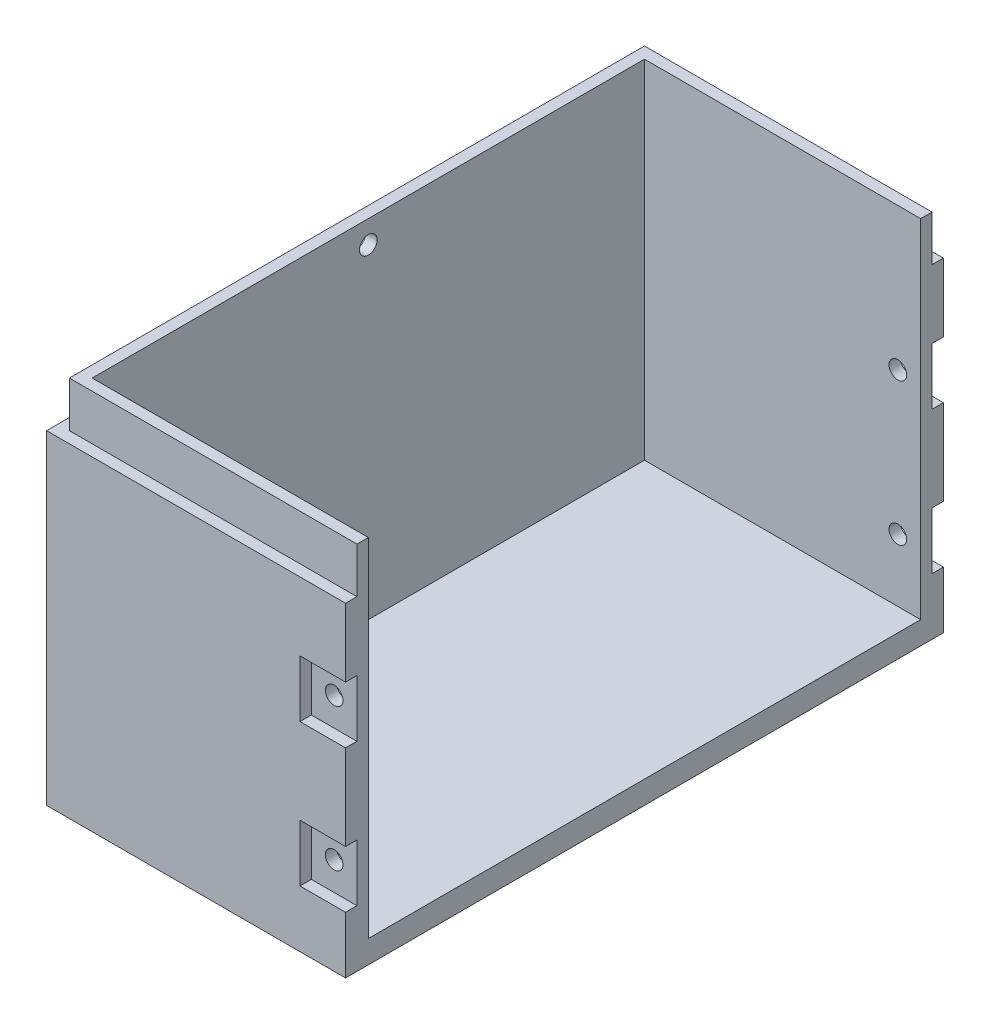
ISO-10303-21;
HEADER;
FILE_DESCRIPTION(('STEP AP214'),'2;1');
FILE_NAME('part.step','',(''),(''),'','','');
FILE_SCHEMA(('AUTOMOTIVE_DESIGN { 1 0 10303 214 1 1 1 1 }'));
ENDSEC;
DATA;
#1=APPLICATION_CONTEXT('core data for automotive mechanical design processes');
#2=APPLICATION_PROTOCOL_DEFINITION('international standard','automotive_design',2000,#1);
#3=PRODUCT_CONTEXT('',#1,'mechanical');
#4=PRODUCT('Part','Part','',(#3));
#5=PRODUCT_RELATED_PRODUCT_CATEGORY('part','',(#4));
#6=PRODUCT_DEFINITION_FORMATION('','',#4);
#7=PRODUCT_DEFINITION_CONTEXT('part definition',#1,'design');
#8=PRODUCT_DEFINITION('design','',#6,#7);
#9=PRODUCT_DEFINITION_SHAPE('','',#8);
#10=(LENGTH_UNIT() NAMED_UNIT(*) SI_UNIT(.MILLI.,.METRE.));
#11=(NAMED_UNIT(*) PLANE_ANGLE_UNIT() SI_UNIT($,.RADIAN.));
#12=(NAMED_UNIT(*) SI_UNIT($,.STERADIAN.) SOLID_ANGLE_UNIT());
#13=UNCERTAINTY_MEASURE_WITH_UNIT(LENGTH_MEASURE(1.E-05),#10,'distance_accuracy_value','');
#14=(GEOMETRIC_REPRESENTATION_CONTEXT(3) GLOBAL_UNCERTAINTY_ASSIGNED_CONTEXT((#13)) GLOBAL_UNIT_ASSIGNED_CONTEXT((#10,
#11,#12)) REPRESENTATION_CONTEXT('',''));
#15=CARTESIAN_POINT('',(0.,0.,0.));
#16=DIRECTION('',(0.,0.,1.));
#17=DIRECTION('',(1.,0.,0.));
#18=AXIS2_PLACEMENT_3D('',#15,#16,#17);
#19=CARTESIAN_POINT('',(0.,0.,-50.5));
#20=DIRECTION('',(0.,0.,-1.));
#21=DIRECTION('',(-1.,0.,0.));
#22=AXIS2_PLACEMENT_3D('',#19,#20,#21);
#23=PLANE('',#22);
#24=CARTESIAN_POINT('',(22.25,15.,-50.5));
#25=DIRECTION('',(0.,0.,-1.));
#26=DIRECTION('',(-1.,0.,0.));
#27=AXIS2_PLACEMENT_3D('',#24,#25,#26);
#28=CIRCLE('',#27,1.55);
#29=CARTESIAN_POINT('',(20.7,15.,-50.5));
#30=VERTEX_POINT('',#29);
#31=EDGE_CURVE('E368',#30,#30,#28,.T.);
#32=ORIENTED_EDGE('',*,*,#31,.F.);
#33=EDGE_LOOP('',(#32));
#34=FACE_BOUND('',#33,.T.);
#35=DIRECTION('',(0.,-1.,0.));
#36=VECTOR('',#35,1.);
#37=CARTESIAN_POINT('',(18.25,0.,-50.5));
#38=LINE('',#37,#36);
#39=CARTESIAN_POINT('',(18.25,20.,-50.5));
#40=VERTEX_POINT('',#39);
#41=CARTESIAN_POINT('',(18.25,10.,-50.5));
#42=VERTEX_POINT('',#41);
#43=EDGE_CURVE('E242',#40,#42,#38,.T.);
#44=ORIENTED_EDGE('',*,*,#43,.F.);
#45=DIRECTION('',(-1.,0.,0.));
#46=VECTOR('',#45,1.);
#47=CARTESIAN_POINT('',(26.25,20.,-50.5));
#48=LINE('',#47,#46);
#49=CARTESIAN_POINT('',(26.25,20.,-50.5));
#50=VERTEX_POINT('',#49);
#51=EDGE_CURVE('E228',#50,#40,#48,.T.);
#52=ORIENTED_EDGE('',*,*,#51,.F.);
#53=DIRECTION('',(0.,-1.,0.));
#54=VECTOR('',#53,1.);
#55=CARTESIAN_POINT('',(26.25,0.,-50.5));
#56=LINE('',#55,#54);
#57=CARTESIAN_POINT('',(26.25,10.,-50.5));
#58=VERTEX_POINT('',#57);
#59=EDGE_CURVE('E240',#50,#58,#56,.T.);
#60=ORIENTED_EDGE('',*,*,#59,.T.);
#61=DIRECTION('',(1.,0.,0.));
#62=VECTOR('',#61,1.);
#63=CARTESIAN_POINT('',(18.25,10.,-50.5));
#64=LINE('',#63,#62);
#65=EDGE_CURVE('E452',#42,#58,#64,.T.);
#66=ORIENTED_EDGE('',*,*,#65,.F.);
#67=EDGE_LOOP('',(#44,#52,#60,#66));
#68=FACE_BOUND('',#67,.T.);
#69=ADVANCED_FACE('F39',(#34,#68),#23,.T.);
#70=CARTESIAN_POINT('',(18.25,0.,-50.5));
#71=DIRECTION('',(1.,0.,0.));
#72=DIRECTION('',(0.,1.,0.));
#73=AXIS2_PLACEMENT_3D('',#70,#71,#72);
#74=PLANE('',#73);
#75=DIRECTION('',(0.,-1.,0.));
#76=VECTOR('',#75,1.);
#77=CARTESIAN_POINT('',(18.25,0.,-52.5));
#78=LINE('',#77,#76);
#79=CARTESIAN_POINT('',(18.25,20.,-52.5));
#80=VERTEX_POINT('',#79);
#81=CARTESIAN_POINT('',(18.25,10.,-52.5));
#82=VERTEX_POINT('',#81);
#83=EDGE_CURVE('E413',#80,#82,#78,.T.);
#84=ORIENTED_EDGE('',*,*,#83,.F.);
#85=DIRECTION('',(0.,0.,1.));
#86=VECTOR('',#85,1.);
#87=CARTESIAN_POINT('',(18.25,20.,-52.5));
#88=LINE('',#87,#86);
#89=EDGE_CURVE('E57',#80,#40,#88,.T.);
#90=ORIENTED_EDGE('',*,*,#89,.T.);
#91=ORIENTED_EDGE('',*,*,#43,.T.);
#92=DIRECTION('',(0.,0.,1.));
#93=VECTOR('',#92,1.);
#94=CARTESIAN_POINT('',(18.25,10.,-52.5));
#95=LINE('',#94,#93);
#96=EDGE_CURVE('E468',#82,#42,#95,.T.);
#97=ORIENTED_EDGE('',*,*,#96,.F.);
#98=EDGE_LOOP('',(#84,#90,#91,#97));
#99=FACE_BOUND('',#98,.T.);
#100=ADVANCED_FACE('F603',(#99),#74,.T.);
#101=CARTESIAN_POINT('',(26.25,65.,-50.5));
#102=VERTEX_POINT('',#101);
#103=CARTESIAN_POINT('',(26.25,57.,-50.5));
#104=VERTEX_POINT('',#103);
#105=EDGE_CURVE('E256',#102,#104,#56,.T.);
#106=ORIENTED_EDGE('',*,*,#105,.T.);
#107=DIRECTION('',(-1.,0.,0.));
#108=VECTOR('',#107,1.);
#109=CARTESIAN_POINT('',(0.,57.,-50.5));
#110=LINE('',#109,#108);
#111=CARTESIAN_POINT('',(-24.25,57.,-50.5));
#112=VERTEX_POINT('',#111);
#113=EDGE_CURVE('E260',#104,#112,#110,.T.);
#114=ORIENTED_EDGE('',*,*,#113,.T.);
#115=DIRECTION('',(0.,-1.,0.));
#116=VECTOR('',#115,1.);
#117=CARTESIAN_POINT('',(-24.25,65.,-50.5));
#118=LINE('',#117,#116);
#119=CARTESIAN_POINT('',(-24.25,65.,-50.5));
#120=VERTEX_POINT('',#119);
#121=EDGE_CURVE('E377',#120,#112,#118,.T.);
#122=ORIENTED_EDGE('',*,*,#121,.F.);
#123=DIRECTION('',(1.,0.,0.));
#124=VECTOR('',#123,1.);
#125=CARTESIAN_POINT('',(0.,65.,-50.5));
#126=LINE('',#125,#124);
#127=EDGE_CURVE('E254',#120,#102,#126,.T.);
#128=ORIENTED_EDGE('',*,*,#127,.T.);
#129=EDGE_LOOP('',(#106,#114,#122,#128));
#130=FACE_BOUND('',#129,.T.);
#131=ADVANCED_FACE('F426',(#130),#23,.T.);
#132=DIRECTION('',(-1.,0.,0.));
#133=VECTOR('',#132,1.);
#134=CARTESIAN_POINT('',(26.25,35.,-50.5));
#135=LINE('',#134,#133);
#136=CARTESIAN_POINT('',(26.25,35.,-50.5));
#137=VERTEX_POINT('',#136);
#138=CARTESIAN_POINT('',(18.25,35.,-50.5));
#139=VERTEX_POINT('',#138);
#140=EDGE_CURVE('E245',#137,#139,#135,.T.);
#141=ORIENTED_EDGE('',*,*,#140,.T.);
#142=CARTESIAN_POINT('',(18.25,45.,-50.5));
#143=VERTEX_POINT('',#142);
#144=EDGE_CURVE('E420',#143,#139,#38,.T.);
#145=ORIENTED_EDGE('',*,*,#144,.F.);
#146=DIRECTION('',(1.,0.,0.));
#147=VECTOR('',#146,1.);
#148=CARTESIAN_POINT('',(18.25,45.,-50.5));
#149=LINE('',#148,#147);
#150=CARTESIAN_POINT('',(26.25,45.,-50.5));
#151=VERTEX_POINT('',#150);
#152=EDGE_CURVE('E448',#143,#151,#149,.T.);
#153=ORIENTED_EDGE('',*,*,#152,.T.);
#154=EDGE_CURVE('E253',#151,#137,#56,.T.);
#155=ORIENTED_EDGE('',*,*,#154,.T.);
#156=EDGE_LOOP('',(#141,#145,#153,#155));
#157=FACE_BOUND('',#156,.T.);
#158=CARTESIAN_POINT('',(22.25,40.,-50.5));
#159=DIRECTION('',(0.,0.,-1.));
#160=DIRECTION('',(-1.,0.,0.));
#161=AXIS2_PLACEMENT_3D('',#158,#159,#160);
#162=CIRCLE('',#161,1.55);
#163=CARTESIAN_POINT('',(20.7,40.,-50.5));
#164=VERTEX_POINT('',#163);
#165=EDGE_CURVE('E347',#164,#164,#162,.T.);
#166=ORIENTED_EDGE('',*,*,#165,.F.);
#167=EDGE_LOOP('',(#166));
#168=FACE_BOUND('',#167,.T.);
#169=ADVANCED_FACE('F606',(#157,#168),#23,.T.);
#170=DIRECTION('',(0.,0.,1.));
#171=VECTOR('',#170,1.);
#172=CARTESIAN_POINT('',(18.25,35.,-52.5));
#173=LINE('',#172,#171);
#174=CARTESIAN_POINT('',(18.25,35.,-52.5));
#175=VERTEX_POINT('',#174);
#176=EDGE_CURVE('E693',#175,#139,#173,.T.);
#177=ORIENTED_EDGE('',*,*,#176,.F.);
#178=CARTESIAN_POINT('',(18.25,45.,-52.5));
#179=VERTEX_POINT('',#178);
#180=EDGE_CURVE('E680',#179,#175,#78,.T.);
#181=ORIENTED_EDGE('',*,*,#180,.F.);
#182=DIRECTION('',(0.,0.,1.));
#183=VECTOR('',#182,1.);
#184=CARTESIAN_POINT('',(18.25,45.,-52.5));
#185=LINE('',#184,#183);
#186=EDGE_CURVE('E244',#179,#143,#185,.T.);
#187=ORIENTED_EDGE('',*,*,#186,.T.);
#188=ORIENTED_EDGE('',*,*,#144,.T.);
#189=EDGE_LOOP('',(#177,#181,#187,#188));
#190=FACE_BOUND('',#189,.T.);
#191=ADVANCED_FACE('F612',(#190),#74,.T.);
#192=CARTESIAN_POINT('',(0.,0.,50.5));
#193=DIRECTION('',(0.,0.,1.));
#194=DIRECTION('',(1.,0.,0.));
#195=AXIS2_PLACEMENT_3D('',#192,#193,#194);
#196=PLANE('',#195);
#197=CARTESIAN_POINT('',(22.25,15.,50.5));
#198=DIRECTION('',(0.,0.,1.));
#199=DIRECTION('',(1.,0.,0.));
#200=AXIS2_PLACEMENT_3D('',#197,#198,#199);
#201=CIRCLE('',#200,1.55);
#202=CARTESIAN_POINT('',(23.8,15.,50.5));
#203=VERTEX_POINT('',#202);
#204=EDGE_CURVE('E341',#203,#203,#201,.T.);
#205=ORIENTED_EDGE('',*,*,#204,.F.);
#206=EDGE_LOOP('',(#205));
#207=FACE_BOUND('',#206,.T.);
#208=DIRECTION('',(0.,1.,0.));
#209=VECTOR('',#208,1.);
#210=CARTESIAN_POINT('',(26.25,0.,50.5));
#211=LINE('',#210,#209);
#212=CARTESIAN_POINT('',(26.25,9.99999999999999,50.5));
#213=VERTEX_POINT('',#212);
#214=CARTESIAN_POINT('',(26.25,20.,50.5));
#215=VERTEX_POINT('',#214);
#216=EDGE_CURVE('E405',#213,#215,#211,.T.);
#217=ORIENTED_EDGE('',*,*,#216,.T.);
#218=DIRECTION('',(1.,0.,0.));
#219=VECTOR('',#218,1.);
#220=CARTESIAN_POINT('',(18.25,20.,50.5));
#221=LINE('',#220,#219);
#222=CARTESIAN_POINT('',(18.25,20.,50.5));
#223=VERTEX_POINT('',#222);
#224=EDGE_CURVE('E65',#223,#215,#221,.T.);
#225=ORIENTED_EDGE('',*,*,#224,.F.);
#226=DIRECTION('',(0.,-1.,0.));
#227=VECTOR('',#226,1.);
#228=CARTESIAN_POINT('',(18.25,0.,50.5));
#229=LINE('',#228,#227);
#230=CARTESIAN_POINT('',(18.25,10.,50.5));
#231=VERTEX_POINT('',#230);
#232=EDGE_CURVE('E398',#223,#231,#229,.T.);
#233=ORIENTED_EDGE('',*,*,#232,.T.);
#234=DIRECTION('',(-1.,0.,0.));
#235=VECTOR('',#234,1.);
#236=CARTESIAN_POINT('',(26.25,10.,50.5));
#237=LINE('',#236,#235);
#238=EDGE_CURVE('E505',#213,#231,#237,.T.);
#239=ORIENTED_EDGE('',*,*,#238,.F.);
#240=EDGE_LOOP('',(#217,#225,#233,#239));
#241=FACE_BOUND('',#240,.T.);
#242=ADVANCED_FACE('F622',(#207,#241),#196,.T.);
#243=CARTESIAN_POINT('',(22.25,40.,50.5));
#244=DIRECTION('',(0.,0.,1.));
#245=DIRECTION('',(1.,0.,0.));
#246=AXIS2_PLACEMENT_3D('',#243,#244,#245);
#247=CIRCLE('',#246,1.55);
#248=CARTESIAN_POINT('',(23.8,40.,50.5));
#249=VERTEX_POINT('',#248);
#250=EDGE_CURVE('E350',#249,#249,#247,.T.);
#251=ORIENTED_EDGE('',*,*,#250,.F.);
#252=EDGE_LOOP('',(#251));
#253=FACE_BOUND('',#252,.T.);
#254=CARTESIAN_POINT('',(18.25,45.,50.5));
#255=VERTEX_POINT('',#254);
#256=CARTESIAN_POINT('',(18.25,35.,50.5));
#257=VERTEX_POINT('',#256);
#258=EDGE_CURVE('E400',#255,#257,#229,.T.);
#259=ORIENTED_EDGE('',*,*,#258,.T.);
#260=DIRECTION('',(-1.,0.,0.));
#261=VECTOR('',#260,1.);
#262=CARTESIAN_POINT('',(18.25,35.,50.5));
#263=LINE('',#262,#261);
#264=CARTESIAN_POINT('',(26.25,35.,50.5));
#265=VERTEX_POINT('',#264);
#266=EDGE_CURVE('E478',#265,#257,#263,.T.);
#267=ORIENTED_EDGE('',*,*,#266,.F.);
#268=CARTESIAN_POINT('',(26.25,45.,50.5));
#269=VERTEX_POINT('',#268);
#270=EDGE_CURVE('E409',#265,#269,#211,.T.);
#271=ORIENTED_EDGE('',*,*,#270,.T.);
#272=DIRECTION('',(1.,0.,0.));
#273=VECTOR('',#272,1.);
#274=CARTESIAN_POINT('',(18.25,45.,50.5));
#275=LINE('',#274,#273);
#276=EDGE_CURVE('E525',#255,#269,#275,.T.);
#277=ORIENTED_EDGE('',*,*,#276,.F.);
#278=EDGE_LOOP('',(#259,#267,#271,#277));
#279=FACE_BOUND('',#278,.T.);
#280=ADVANCED_FACE('F556',(#253,#279),#196,.T.);
#281=CARTESIAN_POINT('',(18.25,0.,50.5));
#282=DIRECTION('',(-1.,0.,0.));
#283=DIRECTION('',(0.,-1.,0.));
#284=AXIS2_PLACEMENT_3D('',#281,#282,#283);
#285=PLANE('',#284);
#286=DIRECTION('',(0.,0.,-1.));
#287=VECTOR('',#286,1.);
#288=CARTESIAN_POINT('',(18.25,20.,52.5));
#289=LINE('',#288,#287);
#290=CARTESIAN_POINT('',(18.25,20.,52.5));
#291=VERTEX_POINT('',#290);
#292=EDGE_CURVE('E501',#291,#223,#289,.T.);
#293=ORIENTED_EDGE('',*,*,#292,.F.);
#294=DIRECTION('',(0.,-1.,0.));
#295=VECTOR('',#294,1.);
#296=CARTESIAN_POINT('',(18.25,0.,52.5));
#297=LINE('',#296,#295);
#298=CARTESIAN_POINT('',(18.25,9.99999999999999,52.5));
#299=VERTEX_POINT('',#298);
#300=EDGE_CURVE('E417',#291,#299,#297,.T.);
#301=ORIENTED_EDGE('',*,*,#300,.T.);
#302=DIRECTION('',(0.,0.,-1.));
#303=VECTOR('',#302,1.);
#304=CARTESIAN_POINT('',(18.25,10.,52.5));
#305=LINE('',#304,#303);
#306=EDGE_CURVE('E514',#299,#231,#305,.T.);
#307=ORIENTED_EDGE('',*,*,#306,.T.);
#308=ORIENTED_EDGE('',*,*,#232,.F.);
#309=EDGE_LOOP('',(#293,#301,#307,#308));
#310=FACE_BOUND('',#309,.T.);
#311=ADVANCED_FACE('F937',(#310),#285,.F.);
#312=DIRECTION('',(0.,0.,-1.));
#313=VECTOR('',#312,1.);
#314=CARTESIAN_POINT('',(18.25,35.,52.5));
#315=LINE('',#314,#313);
#316=CARTESIAN_POINT('',(18.25,35.,52.5));
#317=VERTEX_POINT('',#316);
#318=EDGE_CURVE('E485',#317,#257,#315,.T.);
#319=ORIENTED_EDGE('',*,*,#318,.T.);
#320=ORIENTED_EDGE('',*,*,#258,.F.);
#321=DIRECTION('',(0.,0.,-1.));
#322=VECTOR('',#321,1.);
#323=CARTESIAN_POINT('',(18.25,45.,52.5));
#324=LINE('',#323,#322);
#325=CARTESIAN_POINT('',(18.25,45.,52.5));
#326=VERTEX_POINT('',#325);
#327=EDGE_CURVE('E356',#326,#255,#324,.T.);
#328=ORIENTED_EDGE('',*,*,#327,.F.);
#329=EDGE_CURVE('E399',#326,#317,#297,.T.);
#330=ORIENTED_EDGE('',*,*,#329,.T.);
#331=EDGE_LOOP('',(#319,#320,#328,#330));
#332=FACE_BOUND('',#331,.T.);
#333=ADVANCED_FACE('F553',(#332),#285,.F.);
#334=DIRECTION('',(-1.,0.,0.));
#335=VECTOR('',#334,1.);
#336=CARTESIAN_POINT('',(0.,57.,50.5));
#337=LINE('',#336,#335);
#338=CARTESIAN_POINT('',(26.25,57.,50.5));
#339=VERTEX_POINT('',#338);
#340=CARTESIAN_POINT('',(-24.25,57.,50.5));
#341=VERTEX_POINT('',#340);
#342=EDGE_CURVE('E394',#339,#341,#337,.T.);
#343=ORIENTED_EDGE('',*,*,#342,.F.);
#344=CARTESIAN_POINT('',(26.25,65.,50.5));
#345=VERTEX_POINT('',#344);
#346=EDGE_CURVE('E404',#339,#345,#211,.T.);
#347=ORIENTED_EDGE('',*,*,#346,.T.);
#348=DIRECTION('',(-1.,0.,0.));
#349=VECTOR('',#348,1.);
#350=CARTESIAN_POINT('',(0.,65.,50.5));
#351=LINE('',#350,#349);
#352=CARTESIAN_POINT('',(-24.25,65.,50.5));
#353=VERTEX_POINT('',#352);
#354=EDGE_CURVE('E408',#345,#353,#351,.T.);
#355=ORIENTED_EDGE('',*,*,#354,.T.);
#356=DIRECTION('',(0.,1.,0.));
#357=VECTOR('',#356,1.);
#358=CARTESIAN_POINT('',(-24.25,65.,50.5));
#359=LINE('',#358,#357);
#360=EDGE_CURVE('E387',#341,#353,#359,.T.);
#361=ORIENTED_EDGE('',*,*,#360,.F.);
#362=EDGE_LOOP('',(#343,#347,#355,#361));
#363=FACE_BOUND('',#362,.T.);
#364=ADVANCED_FACE('F567',(#363),#196,.T.);
#365=CARTESIAN_POINT('',(0.,65.,0.));
#366=DIRECTION('',(0.,1.,0.));
#367=DIRECTION('',(0.,0.,1.));
#368=AXIS2_PLACEMENT_3D('',#365,#366,#367);
#369=PLANE('',#368);
#370=ORIENTED_EDGE('',*,*,#127,.F.);
#371=DIRECTION('',(0.,0.,-1.));
#372=VECTOR('',#371,1.);
#373=CARTESIAN_POINT('',(-24.25,65.,-50.5));
#374=LINE('',#373,#372);
#375=EDGE_CURVE('E390',#353,#120,#374,.T.);
#376=ORIENTED_EDGE('',*,*,#375,.F.);
#377=ORIENTED_EDGE('',*,*,#354,.F.);
#378=DIRECTION('',(0.,0.,-1.));
#379=VECTOR('',#378,1.);
#380=CARTESIAN_POINT('',(26.25,65.,-52.5));
#381=LINE('',#380,#379);
#382=CARTESIAN_POINT('',(26.25,65.,48.5));
#383=VERTEX_POINT('',#382);
#384=EDGE_CURVE('E319',#345,#383,#381,.T.);
#385=ORIENTED_EDGE('',*,*,#384,.T.);
#386=DIRECTION('',(1.,0.,0.));
#387=VECTOR('',#386,1.);
#388=CARTESIAN_POINT('',(-22.25,65.,48.5));
#389=LINE('',#388,#387);
#390=CARTESIAN_POINT('',(-22.25,65.,48.5));
#391=VERTEX_POINT('',#390);
#392=EDGE_CURVE('E305',#391,#383,#389,.T.);
#393=ORIENTED_EDGE('',*,*,#392,.F.);
#394=DIRECTION('',(0.,0.,1.));
#395=VECTOR('',#394,1.);
#396=CARTESIAN_POINT('',(-22.25,65.,48.5));
#397=LINE('',#396,#395);
#398=CARTESIAN_POINT('',(-22.25,65.,-48.5));
#399=VERTEX_POINT('',#398);
#400=EDGE_CURVE('E295',#399,#391,#397,.T.);
#401=ORIENTED_EDGE('',*,*,#400,.F.);
#402=DIRECTION('',(1.,0.,0.));
#403=VECTOR('',#402,1.);
#404=CARTESIAN_POINT('',(-22.25,65.,-48.5));
#405=LINE('',#404,#403);
#406=CARTESIAN_POINT('',(26.25,65.,-48.5));
#407=VERTEX_POINT('',#406);
#408=EDGE_CURVE('E310',#399,#407,#405,.T.);
#409=ORIENTED_EDGE('',*,*,#408,.T.);
#410=EDGE_CURVE('E322',#407,#102,#381,.T.);
#411=ORIENTED_EDGE('',*,*,#410,.T.);
#412=EDGE_LOOP('',(#370,#376,#377,#385,#393,#401,#409,#411));
#413=FACE_BOUND('',#412,.T.);
#414=ADVANCED_FACE('F573',(#413),#369,.T.);
#415=CARTESIAN_POINT('',(26.25,65.,-52.5));
#416=DIRECTION('',(-1.,0.,0.));
#417=DIRECTION('',(0.,0.,1.));
#418=AXIS2_PLACEMENT_3D('',#415,#416,#417);
#419=PLANE('',#418);
#420=ORIENTED_EDGE('',*,*,#216,.F.);
#421=DIRECTION('',(0.,0.,-1.));
#422=VECTOR('',#421,1.);
#423=CARTESIAN_POINT('',(26.25,10.,52.5));
#424=LINE('',#423,#422);
#425=CARTESIAN_POINT('',(26.25,10.,52.5));
#426=VERTEX_POINT('',#425);
#427=EDGE_CURVE('E521',#426,#213,#424,.T.);
#428=ORIENTED_EDGE('',*,*,#427,.F.);
#429=DIRECTION('',(0.,1.,0.));
#430=VECTOR('',#429,1.);
#431=CARTESIAN_POINT('',(26.25,0.,52.5));
#432=LINE('',#431,#430);
#433=CARTESIAN_POINT('',(26.25,0.,52.5));
#434=VERTEX_POINT('',#433);
#435=EDGE_CURVE('E506',#434,#426,#432,.T.);
#436=ORIENTED_EDGE('',*,*,#435,.F.);
#437=DIRECTION('',(0.,0.,-1.));
#438=VECTOR('',#437,1.);
#439=CARTESIAN_POINT('',(26.25,0.,-52.5));
#440=LINE('',#439,#438);
#441=CARTESIAN_POINT('',(26.25,0.,-52.5));
#442=VERTEX_POINT('',#441);
#443=EDGE_CURVE('E309',#434,#442,#440,.T.);
#444=ORIENTED_EDGE('',*,*,#443,.T.);
#445=DIRECTION('',(0.,-1.,0.));
#446=VECTOR('',#445,1.);
#447=CARTESIAN_POINT('',(26.25,10.,-52.5));
#448=LINE('',#447,#446);
#449=CARTESIAN_POINT('',(26.25,10.,-52.5));
#450=VERTEX_POINT('',#449);
#451=EDGE_CURVE('E459',#450,#442,#448,.T.);
#452=ORIENTED_EDGE('',*,*,#451,.F.);
#453=DIRECTION('',(0.,0.,1.));
#454=VECTOR('',#453,1.);
#455=CARTESIAN_POINT('',(26.25,10.,-52.5));
#456=LINE('',#455,#454);
#457=EDGE_CURVE('E251',#450,#58,#456,.T.);
#458=ORIENTED_EDGE('',*,*,#457,.T.);
#459=ORIENTED_EDGE('',*,*,#59,.F.);
#460=DIRECTION('',(0.,0.,1.));
#461=VECTOR('',#460,1.);
#462=CARTESIAN_POINT('',(26.25,20.,-52.5));
#463=LINE('',#462,#461);
#464=CARTESIAN_POINT('',(26.25,20.,-52.5));
#465=VERTEX_POINT('',#464);
#466=EDGE_CURVE('E225',#465,#50,#463,.T.);
#467=ORIENTED_EDGE('',*,*,#466,.F.);
#468=DIRECTION('',(0.,-1.,0.));
#469=VECTOR('',#468,1.);
#470=CARTESIAN_POINT('',(26.25,35.,-52.5));
#471=LINE('',#470,#469);
#472=CARTESIAN_POINT('',(26.25,35.,-52.5));
#473=VERTEX_POINT('',#472);
#474=EDGE_CURVE('E234',#473,#465,#471,.T.);
#475=ORIENTED_EDGE('',*,*,#474,.F.);
#476=DIRECTION('',(0.,0.,1.));
#477=VECTOR('',#476,1.);
#478=CARTESIAN_POINT('',(26.25,35.,-52.5));
#479=LINE('',#478,#477);
#480=EDGE_CURVE('E235',#473,#137,#479,.T.);
#481=ORIENTED_EDGE('',*,*,#480,.T.);
#482=ORIENTED_EDGE('',*,*,#154,.F.);
#483=DIRECTION('',(0.,0.,1.));
#484=VECTOR('',#483,1.);
#485=CARTESIAN_POINT('',(26.25,45.,-52.5));
#486=LINE('',#485,#484);
#487=CARTESIAN_POINT('',(26.25,45.,-52.5));
#488=VERTEX_POINT('',#487);
#489=EDGE_CURVE('E439',#488,#151,#486,.T.);
#490=ORIENTED_EDGE('',*,*,#489,.F.);
#491=DIRECTION('',(0.,-1.,0.));
#492=VECTOR('',#491,1.);
#493=CARTESIAN_POINT('',(26.25,57.,-52.5));
#494=LINE('',#493,#492);
#495=CARTESIAN_POINT('',(26.25,57.,-52.5));
#496=VERTEX_POINT('',#495);
#497=EDGE_CURVE('E437',#496,#488,#494,.T.);
#498=ORIENTED_EDGE('',*,*,#497,.F.);
#499=DIRECTION('',(0.,0.,1.));
#500=VECTOR('',#499,1.);
#501=CARTESIAN_POINT('',(26.25,57.,-52.5));
#502=LINE('',#501,#500);
#503=EDGE_CURVE('E432',#496,#104,#502,.T.);
#504=ORIENTED_EDGE('',*,*,#503,.T.);
#505=ORIENTED_EDGE('',*,*,#105,.F.);
#506=ORIENTED_EDGE('',*,*,#410,.F.);
#507=DIRECTION('',(0.,1.,0.));
#508=VECTOR('',#507,1.);
#509=CARTESIAN_POINT('',(26.25,65.,-48.5));
#510=LINE('',#509,#508);
#511=CARTESIAN_POINT('',(26.25,4.,-48.5));
#512=VERTEX_POINT('',#511);
#513=EDGE_CURVE('E288',#512,#407,#510,.T.);
#514=ORIENTED_EDGE('',*,*,#513,.F.);
#515=DIRECTION('',(0.,0.,-1.));
#516=VECTOR('',#515,1.);
#517=CARTESIAN_POINT('',(26.25,4.,48.5));
#518=LINE('',#517,#516);
#519=CARTESIAN_POINT('',(26.25,4.,48.5));
#520=VERTEX_POINT('',#519);
#521=EDGE_CURVE('E278',#520,#512,#518,.T.);
#522=ORIENTED_EDGE('',*,*,#521,.F.);
#523=DIRECTION('',(0.,-1.,0.));
#524=VECTOR('',#523,1.);
#525=CARTESIAN_POINT('',(26.25,65.,48.5));
#526=LINE('',#525,#524);
#527=EDGE_CURVE('E271',#383,#520,#526,.T.);
#528=ORIENTED_EDGE('',*,*,#527,.F.);
#529=ORIENTED_EDGE('',*,*,#384,.F.);
#530=ORIENTED_EDGE('',*,*,#346,.F.);
#531=DIRECTION('',(0.,0.,-1.));
#532=VECTOR('',#531,1.);
#533=CARTESIAN_POINT('',(26.25,57.,52.5));
#534=LINE('',#533,#532);
#535=CARTESIAN_POINT('',(26.25,57.,52.5));
#536=VERTEX_POINT('',#535);
#537=EDGE_CURVE('E533',#536,#339,#534,.T.);
#538=ORIENTED_EDGE('',*,*,#537,.F.);
#539=DIRECTION('',(0.,1.,0.));
#540=VECTOR('',#539,1.);
#541=CARTESIAN_POINT('',(26.25,57.,52.5));
#542=LINE('',#541,#540);
#543=CARTESIAN_POINT('',(26.25,45.,52.5));
#544=VERTEX_POINT('',#543);
#545=EDGE_CURVE('E529',#544,#536,#542,.T.);
#546=ORIENTED_EDGE('',*,*,#545,.F.);
#547=DIRECTION('',(0.,0.,-1.));
#548=VECTOR('',#547,1.);
#549=CARTESIAN_POINT('',(26.25,45.,52.5));
#550=LINE('',#549,#548);
#551=EDGE_CURVE('E539',#544,#269,#550,.T.);
#552=ORIENTED_EDGE('',*,*,#551,.T.);
#553=ORIENTED_EDGE('',*,*,#270,.F.);
#554=DIRECTION('',(0.,0.,-1.));
#555=VECTOR('',#554,1.);
#556=CARTESIAN_POINT('',(26.25,35.,52.5));
#557=LINE('',#556,#555);
#558=CARTESIAN_POINT('',(26.25,35.,52.5));
#559=VERTEX_POINT('',#558);
#560=EDGE_CURVE('E493',#559,#265,#557,.T.);
#561=ORIENTED_EDGE('',*,*,#560,.F.);
#562=DIRECTION('',(0.,1.,0.));
#563=VECTOR('',#562,1.);
#564=CARTESIAN_POINT('',(26.25,35.,52.5));
#565=LINE('',#564,#563);
#566=CARTESIAN_POINT('',(26.25,20.,52.5));
#567=VERTEX_POINT('',#566);
#568=EDGE_CURVE('E477',#567,#559,#565,.T.);
#569=ORIENTED_EDGE('',*,*,#568,.F.);
#570=DIRECTION('',(0.,0.,-1.));
#571=VECTOR('',#570,1.);
#572=CARTESIAN_POINT('',(26.25,20.,52.5));
#573=LINE('',#572,#571);
#574=EDGE_CURVE('E497',#567,#215,#573,.T.);
#575=ORIENTED_EDGE('',*,*,#574,.T.);
#576=EDGE_LOOP('',(#420,#428,#436,#444,#452,#458,#459,#467,#475,#481,#482,#490,#498,#504,#505,
#506,#514,#522,#528,#529,#530,#538,#546,#552,#553,#561,#569,#575));
#577=FACE_BOUND('',#576,.T.);
#578=ADVANCED_FACE('F41',(#577),#419,.F.);
#579=CARTESIAN_POINT('',(-26.25,65.,-52.5));
#580=DIRECTION('',(1.,0.,0.));
#581=DIRECTION('',(0.,0.,-1.));
#582=AXIS2_PLACEMENT_3D('',#579,#580,#581);
#583=PLANE('',#582);
#584=DIRECTION('',(0.,-1.,0.));
#585=VECTOR('',#584,1.);
#586=CARTESIAN_POINT('',(-26.25,65.,52.5));
#587=LINE('',#586,#585);
#588=CARTESIAN_POINT('',(-26.25,57.,52.5));
#589=VERTEX_POINT('',#588);
#590=CARTESIAN_POINT('',(-26.25,0.,52.5));
#591=VERTEX_POINT('',#590);
#592=EDGE_CURVE('E49',#589,#591,#587,.T.);
#593=ORIENTED_EDGE('',*,*,#592,.F.);
#594=DIRECTION('',(0.,0.,-1.));
#595=VECTOR('',#594,1.);
#596=CARTESIAN_POINT('',(-26.25,57.,-50.5));
#597=LINE('',#596,#595);
#598=CARTESIAN_POINT('',(-26.25,57.,-52.5));
#599=VERTEX_POINT('',#598);
#600=EDGE_CURVE('E265',#589,#599,#597,.T.);
#601=ORIENTED_EDGE('',*,*,#600,.T.);
#602=DIRECTION('',(0.,-1.,0.));
#603=VECTOR('',#602,1.);
#604=CARTESIAN_POINT('',(-26.25,65.,-52.5));
#605=LINE('',#604,#603);
#606=CARTESIAN_POINT('',(-26.25,0.,-52.5));
#607=VERTEX_POINT('',#606);
#608=EDGE_CURVE('E11',#599,#607,#605,.T.);
#609=ORIENTED_EDGE('',*,*,#608,.T.);
#610=DIRECTION('',(0.,0.,1.));
#611=VECTOR('',#610,1.);
#612=CARTESIAN_POINT('',(-26.25,0.,-52.5));
#613=LINE('',#612,#611);
#614=EDGE_CURVE('E329',#607,#591,#613,.T.);
#615=ORIENTED_EDGE('',*,*,#614,.T.);
#616=EDGE_LOOP('',(#593,#601,#609,#615));
#617=FACE_BOUND('',#616,.T.);
#618=ADVANCED_FACE('F671',(#617),#583,.F.);
#619=CARTESIAN_POINT('',(-26.25,65.,52.5));
#620=DIRECTION('',(0.,0.,-1.));
#621=DIRECTION('',(-1.,0.,0.));
#622=AXIS2_PLACEMENT_3D('',#619,#620,#621);
#623=PLANE('',#622);
#624=DIRECTION('',(-1.,0.,0.));
#625=VECTOR('',#624,1.);
#626=CARTESIAN_POINT('',(0.,57.,52.5));
#627=LINE('',#626,#625);
#628=EDGE_CURVE('E393',#536,#589,#627,.T.);
#629=ORIENTED_EDGE('',*,*,#628,.T.);
#630=ORIENTED_EDGE('',*,*,#592,.T.);
#631=DIRECTION('',(1.,0.,0.));
#632=VECTOR('',#631,1.);
#633=CARTESIAN_POINT('',(-26.25,0.,52.5));
#634=LINE('',#633,#632);
#635=EDGE_CURVE('E333',#591,#434,#634,.T.);
#636=ORIENTED_EDGE('',*,*,#635,.T.);
#637=ORIENTED_EDGE('',*,*,#435,.T.);
#638=DIRECTION('',(-1.,0.,0.));
#639=VECTOR('',#638,1.);
#640=CARTESIAN_POINT('',(26.25,10.,52.5));
#641=LINE('',#640,#639);
#642=EDGE_CURVE('E510',#426,#299,#641,.T.);
#643=ORIENTED_EDGE('',*,*,#642,.T.);
#644=ORIENTED_EDGE('',*,*,#300,.F.);
#645=DIRECTION('',(1.,0.,0.));
#646=VECTOR('',#645,1.);
#647=CARTESIAN_POINT('',(18.25,20.,52.5));
#648=LINE('',#647,#646);
#649=EDGE_CURVE('E474',#291,#567,#648,.T.);
#650=ORIENTED_EDGE('',*,*,#649,.T.);
#651=ORIENTED_EDGE('',*,*,#568,.T.);
#652=DIRECTION('',(-1.,0.,0.));
#653=VECTOR('',#652,1.);
#654=CARTESIAN_POINT('',(18.25,35.,52.5));
#655=LINE('',#654,#653);
#656=EDGE_CURVE('E481',#559,#317,#655,.T.);
#657=ORIENTED_EDGE('',*,*,#656,.T.);
#658=ORIENTED_EDGE('',*,*,#329,.F.);
#659=DIRECTION('',(1.,0.,0.));
#660=VECTOR('',#659,1.);
#661=CARTESIAN_POINT('',(18.25,45.,52.5));
#662=LINE('',#661,#660);
#663=EDGE_CURVE('E526',#326,#544,#662,.T.);
#664=ORIENTED_EDGE('',*,*,#663,.T.);
#665=ORIENTED_EDGE('',*,*,#545,.T.);
#666=EDGE_LOOP('',(#629,#630,#636,#637,#643,#644,#650,#651,#657,#658,#664,#665));
#667=FACE_BOUND('',#666,.T.);
#668=ADVANCED_FACE('F668',(#667),#623,.F.);
#669=CARTESIAN_POINT('',(-26.25,65.,-52.5));
#670=DIRECTION('',(0.,0.,1.));
#671=DIRECTION('',(1.,0.,0.));
#672=AXIS2_PLACEMENT_3D('',#669,#670,#671);
#673=PLANE('',#672);
#674=DIRECTION('',(-1.,0.,0.));
#675=VECTOR('',#674,1.);
#676=CARTESIAN_POINT('',(0.,57.,-52.5));
#677=LINE('',#676,#675);
#678=EDGE_CURVE('E282',#496,#599,#677,.T.);
#679=ORIENTED_EDGE('',*,*,#678,.F.);
#680=ORIENTED_EDGE('',*,*,#497,.T.);
#681=DIRECTION('',(1.,0.,0.));
#682=VECTOR('',#681,1.);
#683=CARTESIAN_POINT('',(18.25,45.,-52.5));
#684=LINE('',#683,#682);
#685=EDGE_CURVE('E453',#179,#488,#684,.T.);
#686=ORIENTED_EDGE('',*,*,#685,.F.);
#687=ORIENTED_EDGE('',*,*,#180,.T.);
#688=DIRECTION('',(-1.,0.,0.));
#689=VECTOR('',#688,1.);
#690=CARTESIAN_POINT('',(26.25,35.,-52.5));
#691=LINE('',#690,#689);
#692=EDGE_CURVE('E704',#473,#175,#691,.T.);
#693=ORIENTED_EDGE('',*,*,#692,.F.);
#694=ORIENTED_EDGE('',*,*,#474,.T.);
#695=DIRECTION('',(-1.,0.,0.));
#696=VECTOR('',#695,1.);
#697=CARTESIAN_POINT('',(26.25,20.,-52.5));
#698=LINE('',#697,#696);
#699=EDGE_CURVE('E229',#465,#80,#698,.T.);
#700=ORIENTED_EDGE('',*,*,#699,.T.);
#701=ORIENTED_EDGE('',*,*,#83,.T.);
#702=DIRECTION('',(1.,0.,0.));
#703=VECTOR('',#702,1.);
#704=CARTESIAN_POINT('',(18.25,10.,-52.5));
#705=LINE('',#704,#703);
#706=EDGE_CURVE('E463',#82,#450,#705,.T.);
#707=ORIENTED_EDGE('',*,*,#706,.T.);
#708=ORIENTED_EDGE('',*,*,#451,.T.);
#709=DIRECTION('',(-1.,0.,0.));
#710=VECTOR('',#709,1.);
#711=CARTESIAN_POINT('',(-26.25,0.,-52.5));
#712=LINE('',#711,#710);
#713=EDGE_CURVE('E325',#442,#607,#712,.T.);
#714=ORIENTED_EDGE('',*,*,#713,.T.);
#715=ORIENTED_EDGE('',*,*,#608,.F.);
#716=EDGE_LOOP('',(#679,#680,#686,#687,#693,#694,#700,#701,#707,#708,#714,#715));
#717=FACE_BOUND('',#716,.T.);
#718=ADVANCED_FACE('F662',(#717),#673,.F.);
#719=CARTESIAN_POINT('',(0.,0.,0.));
#720=DIRECTION('',(0.,1.,0.));
#721=DIRECTION('',(0.,0.,1.));
#722=AXIS2_PLACEMENT_3D('',#719,#720,#721);
#723=PLANE('',#722);
#724=ORIENTED_EDGE('',*,*,#443,.F.);
#725=ORIENTED_EDGE('',*,*,#635,.F.);
#726=ORIENTED_EDGE('',*,*,#614,.F.);
#727=ORIENTED_EDGE('',*,*,#713,.F.);
#728=EDGE_LOOP('',(#724,#725,#726,#727));
#729=FACE_BOUND('',#728,.T.);
#730=ADVANCED_FACE('F657',(#729),#723,.F.);
#731=CARTESIAN_POINT('',(-22.25,65.,48.5));
#732=DIRECTION('',(0.,0.,1.));
#733=DIRECTION('',(1.,0.,0.));
#734=AXIS2_PLACEMENT_3D('',#731,#732,#733);
#735=PLANE('',#734);
#736=CARTESIAN_POINT('',(22.25,15.,48.5));
#737=DIRECTION('',(0.,0.,1.));
#738=DIRECTION('',(1.,0.,0.));
#739=AXIS2_PLACEMENT_3D('',#736,#737,#738);
#740=CIRCLE('',#739,1.55);
#741=CARTESIAN_POINT('',(23.8,15.,48.5));
#742=VERTEX_POINT('',#741);
#743=EDGE_CURVE('E364',#742,#742,#740,.T.);
#744=ORIENTED_EDGE('',*,*,#743,.T.);
#745=EDGE_LOOP('',(#744));
#746=FACE_BOUND('',#745,.T.);
#747=CARTESIAN_POINT('',(22.25,40.,48.5));
#748=DIRECTION('',(0.,0.,1.));
#749=DIRECTION('',(1.,0.,0.));
#750=AXIS2_PLACEMENT_3D('',#747,#748,#749);
#751=CIRCLE('',#750,1.55);
#752=CARTESIAN_POINT('',(23.8,40.,48.5));
#753=VERTEX_POINT('',#752);
#754=EDGE_CURVE('E340',#753,#753,#751,.T.);
#755=ORIENTED_EDGE('',*,*,#754,.T.);
#756=EDGE_LOOP('',(#755));
#757=FACE_BOUND('',#756,.T.);
#758=ORIENTED_EDGE('',*,*,#527,.T.);
#759=DIRECTION('',(1.,0.,0.));
#760=VECTOR('',#759,1.);
#761=CARTESIAN_POINT('',(-22.25,4.,48.5));
#762=LINE('',#761,#760);
#763=CARTESIAN_POINT('',(-22.25,4.,48.5));
#764=VERTEX_POINT('',#763);
#765=EDGE_CURVE('E298',#764,#520,#762,.T.);
#766=ORIENTED_EDGE('',*,*,#765,.F.);
#767=DIRECTION('',(0.,-1.,0.));
#768=VECTOR('',#767,1.);
#769=CARTESIAN_POINT('',(-22.25,65.,48.5));
#770=LINE('',#769,#768);
#771=EDGE_CURVE('E283',#391,#764,#770,.T.);
#772=ORIENTED_EDGE('',*,*,#771,.F.);
#773=ORIENTED_EDGE('',*,*,#392,.T.);
#774=EDGE_LOOP('',(#758,#766,#772,#773));
#775=FACE_BOUND('',#774,.T.);
#776=ADVANCED_FACE('F579',(#746,#757,#775),#735,.F.);
#777=CARTESIAN_POINT('',(-22.25,65.,-48.5));
#778=DIRECTION('',(0.,0.,-1.));
#779=DIRECTION('',(-1.,0.,0.));
#780=AXIS2_PLACEMENT_3D('',#777,#778,#779);
#781=PLANE('',#780);
#782=CARTESIAN_POINT('',(22.25,15.,-48.5));
#783=DIRECTION('',(0.,0.,-1.));
#784=DIRECTION('',(-1.,0.,0.));
#785=AXIS2_PLACEMENT_3D('',#782,#783,#784);
#786=CIRCLE('',#785,1.55);
#787=CARTESIAN_POINT('',(20.7,15.,-48.5));
#788=VERTEX_POINT('',#787);
#789=EDGE_CURVE('E43',#788,#788,#786,.T.);
#790=ORIENTED_EDGE('',*,*,#789,.T.);
#791=EDGE_LOOP('',(#790));
#792=FACE_BOUND('',#791,.T.);
#793=CARTESIAN_POINT('',(22.25,40.,-48.5));
#794=DIRECTION('',(0.,0.,-1.));
#795=DIRECTION('',(-1.,0.,0.));
#796=AXIS2_PLACEMENT_3D('',#793,#794,#795);
#797=CIRCLE('',#796,1.55);
#798=CARTESIAN_POINT('',(20.7,40.,-48.5));
#799=VERTEX_POINT('',#798);
#800=EDGE_CURVE('E337',#799,#799,#797,.T.);
#801=ORIENTED_EDGE('',*,*,#800,.T.);
#802=EDGE_LOOP('',(#801));
#803=FACE_BOUND('',#802,.T.);
#804=ORIENTED_EDGE('',*,*,#513,.T.);
#805=ORIENTED_EDGE('',*,*,#408,.F.);
#806=DIRECTION('',(0.,1.,0.));
#807=VECTOR('',#806,1.);
#808=CARTESIAN_POINT('',(-22.25,65.,-48.5));
#809=LINE('',#808,#807);
#810=CARTESIAN_POINT('',(-22.25,4.,-48.5));
#811=VERTEX_POINT('',#810);
#812=EDGE_CURVE('E292',#811,#399,#809,.T.);
#813=ORIENTED_EDGE('',*,*,#812,.F.);
#814=DIRECTION('',(1.,0.,0.));
#815=VECTOR('',#814,1.);
#816=CARTESIAN_POINT('',(-22.25,4.,-48.5));
#817=LINE('',#816,#815);
#818=EDGE_CURVE('E314',#811,#512,#817,.T.);
#819=ORIENTED_EDGE('',*,*,#818,.T.);
#820=EDGE_LOOP('',(#804,#805,#813,#819));
#821=FACE_BOUND('',#820,.T.);
#822=ADVANCED_FACE('F587',(#792,#803,#821),#781,.F.);
#823=CARTESIAN_POINT('',(-22.25,4.,48.5));
#824=DIRECTION('',(0.,-1.,0.));
#825=DIRECTION('',(0.,0.,-1.));
#826=AXIS2_PLACEMENT_3D('',#823,#824,#825);
#827=PLANE('',#826);
#828=ORIENTED_EDGE('',*,*,#521,.T.);
#829=ORIENTED_EDGE('',*,*,#818,.F.);
#830=DIRECTION('',(0.,0.,-1.));
#831=VECTOR('',#830,1.);
#832=CARTESIAN_POINT('',(-22.25,4.,48.5));
#833=LINE('',#832,#831);
#834=EDGE_CURVE('E287',#764,#811,#833,.T.);
#835=ORIENTED_EDGE('',*,*,#834,.F.);
#836=ORIENTED_EDGE('',*,*,#765,.T.);
#837=EDGE_LOOP('',(#828,#829,#835,#836));
#838=FACE_BOUND('',#837,.T.);
#839=ADVANCED_FACE('F590',(#838),#827,.F.);
#840=CARTESIAN_POINT('',(-22.25,0.,0.));
#841=DIRECTION('',(1.,0.,0.));
#842=DIRECTION('',(0.,0.,-1.));
#843=AXIS2_PLACEMENT_3D('',#840,#841,#842);
#844=PLANE('',#843);
#845=CARTESIAN_POINT('',(-22.25,61.,0.));
#846=DIRECTION('',(1.,0.,0.));
#847=DIRECTION('',(0.,0.,-1.));
#848=AXIS2_PLACEMENT_3D('',#845,#846,#847);
#849=CIRCLE('',#848,1.55);
#850=CARTESIAN_POINT('',(-22.25,61.,-1.55));
#851=VERTEX_POINT('',#850);
#852=EDGE_CURVE('E372',#851,#851,#849,.F.);
#853=ORIENTED_EDGE('',*,*,#852,.T.);
#854=EDGE_LOOP('',(#853));
#855=FACE_BOUND('',#854,.T.);
#856=ORIENTED_EDGE('',*,*,#771,.T.);
#857=ORIENTED_EDGE('',*,*,#834,.T.);
#858=ORIENTED_EDGE('',*,*,#812,.T.);
#859=ORIENTED_EDGE('',*,*,#400,.T.);
#860=EDGE_LOOP('',(#856,#857,#858,#859));
#861=FACE_BOUND('',#860,.T.);
#862=ADVANCED_FACE('F584',(#855,#861),#844,.T.);
#863=CARTESIAN_POINT('',(0.,57.,-50.5));
#864=DIRECTION('',(0.,-1.,0.));
#865=DIRECTION('',(0.,0.,-1.));
#866=AXIS2_PLACEMENT_3D('',#863,#864,#865);
#867=PLANE('',#866);
#868=ORIENTED_EDGE('',*,*,#678,.T.);
#869=ORIENTED_EDGE('',*,*,#600,.F.);
#870=ORIENTED_EDGE('',*,*,#628,.F.);
#871=ORIENTED_EDGE('',*,*,#537,.T.);
#872=ORIENTED_EDGE('',*,*,#342,.T.);
#873=DIRECTION('',(0.,0.,1.));
#874=VECTOR('',#873,1.);
#875=CARTESIAN_POINT('',(-24.25,57.,-50.5));
#876=LINE('',#875,#874);
#877=EDGE_CURVE('E384',#112,#341,#876,.T.);
#878=ORIENTED_EDGE('',*,*,#877,.F.);
#879=ORIENTED_EDGE('',*,*,#113,.F.);
#880=ORIENTED_EDGE('',*,*,#503,.F.);
#881=EDGE_LOOP('',(#868,#869,#870,#871,#872,#878,#879,#880));
#882=FACE_BOUND('',#881,.T.);
#883=ADVANCED_FACE('F431',(#882),#867,.F.);
#884=CARTESIAN_POINT('',(-24.25,0.,0.));
#885=DIRECTION('',(-1.,0.,0.));
#886=DIRECTION('',(0.,0.,1.));
#887=AXIS2_PLACEMENT_3D('',#884,#885,#886);
#888=PLANE('',#887);
#889=CARTESIAN_POINT('',(-24.25,61.,0.));
#890=DIRECTION('',(-1.,0.,0.));
#891=DIRECTION('',(0.,0.,1.));
#892=AXIS2_PLACEMENT_3D('',#889,#890,#891);
#893=CIRCLE('',#892,1.55);
#894=CARTESIAN_POINT('',(-24.25,61.,1.55));
#895=VERTEX_POINT('',#894);
#896=EDGE_CURVE('E373',#895,#895,#893,.T.);
#897=ORIENTED_EDGE('',*,*,#896,.F.);
#898=EDGE_LOOP('',(#897));
#899=FACE_BOUND('',#898,.T.);
#900=ORIENTED_EDGE('',*,*,#121,.T.);
#901=ORIENTED_EDGE('',*,*,#877,.T.);
#902=ORIENTED_EDGE('',*,*,#360,.T.);
#903=ORIENTED_EDGE('',*,*,#375,.T.);
#904=EDGE_LOOP('',(#900,#901,#902,#903));
#905=FACE_BOUND('',#904,.T.);
#906=ADVANCED_FACE('F644',(#899,#905),#888,.T.);
#907=CARTESIAN_POINT('',(26.251,61.,0.));
#908=DIRECTION('',(-1.,0.,0.));
#909=DIRECTION('',(0.,0.,1.));
#910=AXIS2_PLACEMENT_3D('',#907,#908,#909);
#911=CYLINDRICAL_SURFACE('',#910,1.55);
#912=ORIENTED_EDGE('',*,*,#852,.F.);
#913=EDGE_LOOP('',(#912));
#914=FACE_BOUND('',#913,.T.);
#915=ORIENTED_EDGE('',*,*,#896,.T.);
#916=EDGE_LOOP('',(#915));
#917=FACE_BOUND('',#916,.T.);
#918=ADVANCED_FACE('F634',(#914,#917),#911,.F.);
#919=CARTESIAN_POINT('',(22.25,40.,-52.5));
#920=DIRECTION('',(0.,0.,1.));
#921=DIRECTION('',(1.,0.,0.));
#922=AXIS2_PLACEMENT_3D('',#919,#920,#921);
#923=CYLINDRICAL_SURFACE('',#922,1.55);
#924=ORIENTED_EDGE('',*,*,#165,.T.);
#925=EDGE_LOOP('',(#924));
#926=FACE_BOUND('',#925,.T.);
#927=ORIENTED_EDGE('',*,*,#800,.F.);
#928=EDGE_LOOP('',(#927));
#929=FACE_BOUND('',#928,.T.);
#930=ADVANCED_FACE('F630',(#926,#929),#923,.F.);
#931=CARTESIAN_POINT('',(22.25,15.,-52.5));
#932=DIRECTION('',(0.,0.,1.));
#933=DIRECTION('',(1.,0.,0.));
#934=AXIS2_PLACEMENT_3D('',#931,#932,#933);
#935=CYLINDRICAL_SURFACE('',#934,1.55);
#936=ORIENTED_EDGE('',*,*,#31,.T.);
#937=EDGE_LOOP('',(#936));
#938=FACE_BOUND('',#937,.T.);
#939=ORIENTED_EDGE('',*,*,#789,.F.);
#940=EDGE_LOOP('',(#939));
#941=FACE_BOUND('',#940,.T.);
#942=ADVANCED_FACE('F633',(#938,#941),#935,.F.);
#943=ORIENTED_EDGE('',*,*,#250,.T.);
#944=EDGE_LOOP('',(#943));
#945=FACE_BOUND('',#944,.T.);
#946=ORIENTED_EDGE('',*,*,#754,.F.);
#947=EDGE_LOOP('',(#946));
#948=FACE_BOUND('',#947,.T.);
#949=ADVANCED_FACE('F636',(#945,#948),#923,.F.);
#950=ORIENTED_EDGE('',*,*,#204,.T.);
#951=EDGE_LOOP('',(#950));
#952=FACE_BOUND('',#951,.T.);
#953=ORIENTED_EDGE('',*,*,#743,.F.);
#954=EDGE_LOOP('',(#953));
#955=FACE_BOUND('',#954,.T.);
#956=ADVANCED_FACE('F643',(#952,#955),#935,.F.);
#957=CARTESIAN_POINT('',(18.25,45.,52.5));
#958=DIRECTION('',(0.,1.,0.));
#959=DIRECTION('',(-1.,0.,0.));
#960=AXIS2_PLACEMENT_3D('',#957,#958,#959);
#961=PLANE('',#960);
#962=ORIENTED_EDGE('',*,*,#276,.T.);
#963=ORIENTED_EDGE('',*,*,#551,.F.);
#964=ORIENTED_EDGE('',*,*,#663,.F.);
#965=ORIENTED_EDGE('',*,*,#327,.T.);
#966=EDGE_LOOP('',(#962,#963,#964,#965));
#967=FACE_BOUND('',#966,.T.);
#968=ADVANCED_FACE('F550',(#967),#961,.F.);
#969=CARTESIAN_POINT('',(26.25,10.,52.5));
#970=DIRECTION('',(0.,-1.,0.));
#971=DIRECTION('',(1.,0.,0.));
#972=AXIS2_PLACEMENT_3D('',#969,#970,#971);
#973=PLANE('',#972);
#974=ORIENTED_EDGE('',*,*,#238,.T.);
#975=ORIENTED_EDGE('',*,*,#306,.F.);
#976=ORIENTED_EDGE('',*,*,#642,.F.);
#977=ORIENTED_EDGE('',*,*,#427,.T.);
#978=EDGE_LOOP('',(#974,#975,#976,#977));
#979=FACE_BOUND('',#978,.T.);
#980=ADVANCED_FACE('F728',(#979),#973,.F.);
#981=CARTESIAN_POINT('',(18.25,20.,52.5));
#982=DIRECTION('',(0.,1.,0.));
#983=DIRECTION('',(0.,0.,1.));
#984=AXIS2_PLACEMENT_3D('',#981,#982,#983);
#985=PLANE('',#984);
#986=ORIENTED_EDGE('',*,*,#224,.T.);
#987=ORIENTED_EDGE('',*,*,#574,.F.);
#988=ORIENTED_EDGE('',*,*,#649,.F.);
#989=ORIENTED_EDGE('',*,*,#292,.T.);
#990=EDGE_LOOP('',(#986,#987,#988,#989));
#991=FACE_BOUND('',#990,.T.);
#992=ADVANCED_FACE('F725',(#991),#985,.F.);
#993=CARTESIAN_POINT('',(18.25,35.,52.5));
#994=DIRECTION('',(0.,-1.,0.));
#995=DIRECTION('',(0.,0.,-1.));
#996=AXIS2_PLACEMENT_3D('',#993,#994,#995);
#997=PLANE('',#996);
#998=ORIENTED_EDGE('',*,*,#266,.T.);
#999=ORIENTED_EDGE('',*,*,#318,.F.);
#1000=ORIENTED_EDGE('',*,*,#656,.F.);
#1001=ORIENTED_EDGE('',*,*,#560,.T.);
#1002=EDGE_LOOP('',(#998,#999,#1000,#1001));
#1003=FACE_BOUND('',#1002,.T.);
#1004=ADVANCED_FACE('F558',(#1003),#997,.F.);
#1005=CARTESIAN_POINT('',(18.25,10.,-52.5));
#1006=DIRECTION('',(0.,-1.,0.));
#1007=DIRECTION('',(1.,0.,0.));
#1008=AXIS2_PLACEMENT_3D('',#1005,#1006,#1007);
#1009=PLANE('',#1008);
#1010=ORIENTED_EDGE('',*,*,#65,.T.);
#1011=ORIENTED_EDGE('',*,*,#457,.F.);
#1012=ORIENTED_EDGE('',*,*,#706,.F.);
#1013=ORIENTED_EDGE('',*,*,#96,.T.);
#1014=EDGE_LOOP('',(#1010,#1011,#1012,#1013));
#1015=FACE_BOUND('',#1014,.T.);
#1016=ADVANCED_FACE('F691',(#1015),#1009,.F.);
#1017=CARTESIAN_POINT('',(18.25,45.,-52.5));
#1018=DIRECTION('',(0.,-1.,0.));
#1019=DIRECTION('',(0.,0.,-1.));
#1020=AXIS2_PLACEMENT_3D('',#1017,#1018,#1019);
#1021=PLANE('',#1020);
#1022=ORIENTED_EDGE('',*,*,#152,.F.);
#1023=ORIENTED_EDGE('',*,*,#186,.F.);
#1024=ORIENTED_EDGE('',*,*,#685,.T.);
#1025=ORIENTED_EDGE('',*,*,#489,.T.);
#1026=EDGE_LOOP('',(#1022,#1023,#1024,#1025));
#1027=FACE_BOUND('',#1026,.T.);
#1028=ADVANCED_FACE('F712',(#1027),#1021,.T.);
#1029=CARTESIAN_POINT('',(26.25,20.,-52.5));
#1030=DIRECTION('',(0.,1.,0.));
#1031=DIRECTION('',(-1.,0.,0.));
#1032=AXIS2_PLACEMENT_3D('',#1029,#1030,#1031);
#1033=PLANE('',#1032);
#1034=ORIENTED_EDGE('',*,*,#51,.T.);
#1035=ORIENTED_EDGE('',*,*,#89,.F.);
#1036=ORIENTED_EDGE('',*,*,#699,.F.);
#1037=ORIENTED_EDGE('',*,*,#466,.T.);
#1038=EDGE_LOOP('',(#1034,#1035,#1036,#1037));
#1039=FACE_BOUND('',#1038,.T.);
#1040=ADVANCED_FACE('F227',(#1039),#1033,.F.);
#1041=CARTESIAN_POINT('',(26.25,35.,-52.5));
#1042=DIRECTION('',(0.,1.,0.));
#1043=DIRECTION('',(0.,0.,1.));
#1044=AXIS2_PLACEMENT_3D('',#1041,#1042,#1043);
#1045=PLANE('',#1044);
#1046=ORIENTED_EDGE('',*,*,#140,.F.);
#1047=ORIENTED_EDGE('',*,*,#480,.F.);
#1048=ORIENTED_EDGE('',*,*,#692,.T.);
#1049=ORIENTED_EDGE('',*,*,#176,.T.);
#1050=EDGE_LOOP('',(#1046,#1047,#1048,#1049));
#1051=FACE_BOUND('',#1050,.T.);
#1052=ADVANCED_FACE('F709',(#1051),#1045,.T.);
#1053=CLOSED_SHELL('',(#69,#100,#131,#169,#191,#242,#280,#311,#333,#364,#414,#578,#618,#668,
#718,#730,#776,#822,#839,#862,#883,#906,#918,#930,#942,#949,#956,#968,#980,#992,#1004,#1016,
#1028,#1040,#1052));
#1054=MANIFOLD_SOLID_BREP('B2',#1053);
#1055=ADVANCED_BREP_SHAPE_REPRESENTATION('',(#18,#1054),#14);
#1056=SHAPE_DEFINITION_REPRESENTATION(#9,#1055);
ENDSEC;
END-ISO-10303-21;
